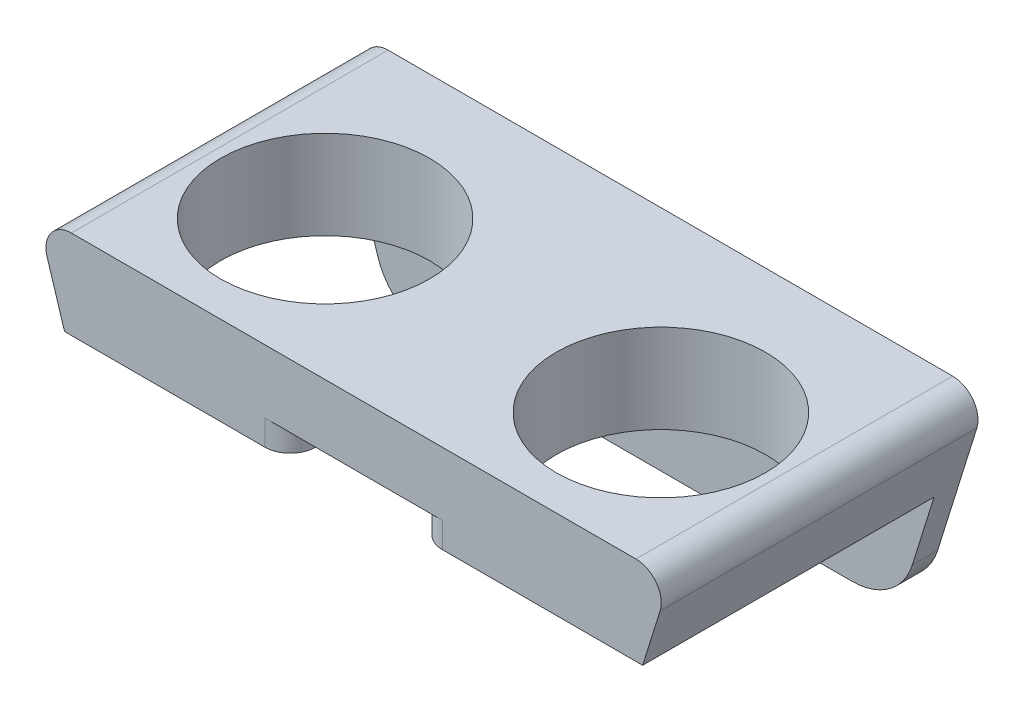
ISO-10303-21;
HEADER;
FILE_DESCRIPTION(('STEP AP214'),'2;1');
FILE_NAME('part.step','',(''),(''),'','','');
FILE_SCHEMA(('AUTOMOTIVE_DESIGN { 1 0 10303 214 1 1 1 1 }'));
ENDSEC;
DATA;
#1=APPLICATION_CONTEXT('core data for automotive mechanical design processes');
#2=APPLICATION_PROTOCOL_DEFINITION('international standard','automotive_design',2000,#1);
#3=PRODUCT_CONTEXT('',#1,'mechanical');
#4=PRODUCT('Part','Part','',(#3));
#5=PRODUCT_RELATED_PRODUCT_CATEGORY('part','',(#4));
#6=PRODUCT_DEFINITION_FORMATION('','',#4);
#7=PRODUCT_DEFINITION_CONTEXT('part definition',#1,'design');
#8=PRODUCT_DEFINITION('design','',#6,#7);
#9=PRODUCT_DEFINITION_SHAPE('','',#8);
#10=(LENGTH_UNIT() NAMED_UNIT(*) SI_UNIT(.MILLI.,.METRE.));
#11=(NAMED_UNIT(*) PLANE_ANGLE_UNIT() SI_UNIT($,.RADIAN.));
#12=(NAMED_UNIT(*) SI_UNIT($,.STERADIAN.) SOLID_ANGLE_UNIT());
#13=UNCERTAINTY_MEASURE_WITH_UNIT(LENGTH_MEASURE(1.E-05),#10,'distance_accuracy_value','');
#14=(GEOMETRIC_REPRESENTATION_CONTEXT(3) GLOBAL_UNCERTAINTY_ASSIGNED_CONTEXT((#13)) GLOBAL_UNIT_ASSIGNED_CONTEXT((#10,
#11,#12)) REPRESENTATION_CONTEXT('',''));
#15=CARTESIAN_POINT('',(0.,0.,0.));
#16=DIRECTION('',(0.,0.,1.));
#17=DIRECTION('',(1.,0.,0.));
#18=AXIS2_PLACEMENT_3D('',#15,#16,#17);
#19=CARTESIAN_POINT('',(0.,7.,0.));
#20=DIRECTION('',(0.,1.,0.));
#21=DIRECTION('',(0.,0.,1.));
#22=AXIS2_PLACEMENT_3D('',#19,#20,#21);
#23=PLANE('',#22);
#24=CARTESIAN_POINT('',(-11.75,7.,-12.));
#25=DIRECTION('',(0.,1.,0.));
#26=DIRECTION('',(0.,0.,1.));
#27=AXIS2_PLACEMENT_3D('',#24,#25,#26);
#28=CIRCLE('',#27,8.25);
#29=CARTESIAN_POINT('',(-11.75,7.,-3.75));
#30=VERTEX_POINT('',#29);
#31=EDGE_CURVE('E415',#30,#30,#28,.T.);
#32=ORIENTED_EDGE('',*,*,#31,.F.);
#33=EDGE_LOOP('',(#32));
#34=FACE_BOUND('',#33,.T.);
#35=CARTESIAN_POINT('',(-38.25,7.,-12.));
#36=DIRECTION('',(0.,1.,0.));
#37=DIRECTION('',(0.,0.,1.));
#38=AXIS2_PLACEMENT_3D('',#35,#36,#37);
#39=CIRCLE('',#38,8.25);
#40=CARTESIAN_POINT('',(-38.25,7.,-3.75));
#41=VERTEX_POINT('',#40);
#42=EDGE_CURVE('E407',#41,#41,#39,.T.);
#43=ORIENTED_EDGE('',*,*,#42,.F.);
#44=EDGE_LOOP('',(#43));
#45=FACE_BOUND('',#44,.T.);
#46=DIRECTION('',(0.,0.,1.));
#47=VECTOR('',#46,1.);
#48=CARTESIAN_POINT('',(-47.27961817322,7.,0.));
#49=LINE('',#48,#47);
#50=CARTESIAN_POINT('',(-47.27961817322,7.,-26.));
#51=VERTEX_POINT('',#50);
#52=CARTESIAN_POINT('',(-47.27961817322,7.,-1.));
#53=VERTEX_POINT('',#52);
#54=EDGE_CURVE('E209',#51,#53,#49,.T.);
#55=ORIENTED_EDGE('',*,*,#54,.T.);
#56=DIRECTION('',(1.,0.,0.));
#57=VECTOR('',#56,1.);
#58=CARTESIAN_POINT('',(0.,7.,-1.));
#59=LINE('',#58,#57);
#60=CARTESIAN_POINT('',(-2.72038182678003,7.,-1.));
#61=VERTEX_POINT('',#60);
#62=EDGE_CURVE('E191',#53,#61,#59,.T.);
#63=ORIENTED_EDGE('',*,*,#62,.T.);
#64=DIRECTION('',(0.,0.,-1.));
#65=VECTOR('',#64,1.);
#66=CARTESIAN_POINT('',(-2.72038182678003,7.,-26.));
#67=LINE('',#66,#65);
#68=CARTESIAN_POINT('',(-2.72038182678003,7.,-26.));
#69=VERTEX_POINT('',#68);
#70=EDGE_CURVE('E206',#61,#69,#67,.T.);
#71=ORIENTED_EDGE('',*,*,#70,.T.);
#72=DIRECTION('',(1.,0.,0.));
#73=VECTOR('',#72,1.);
#74=CARTESIAN_POINT('',(0.,7.,-26.));
#75=LINE('',#74,#73);
#76=EDGE_CURVE('E356',#51,#69,#75,.T.);
#77=ORIENTED_EDGE('',*,*,#76,.F.);
#78=EDGE_LOOP('',(#55,#63,#71,#77));
#79=FACE_BOUND('',#78,.T.);
#80=ADVANCED_FACE('F39',(#34,#45,#79),#23,.T.);
#81=CARTESIAN_POINT('',(0.,0.,0.));
#82=DIRECTION('',(0.,1.,0.));
#83=DIRECTION('',(0.,0.,1.));
#84=AXIS2_PLACEMENT_3D('',#81,#82,#83);
#85=PLANE('',#84);
#86=CARTESIAN_POINT('',(-38.25,0.,-12.));
#87=DIRECTION('',(0.,1.,0.));
#88=DIRECTION('',(0.,0.,1.));
#89=AXIS2_PLACEMENT_3D('',#86,#87,#88);
#90=CIRCLE('',#89,8.25);
#91=CARTESIAN_POINT('',(-38.25,0.,-3.75));
#92=VERTEX_POINT('',#91);
#93=EDGE_CURVE('E397',#92,#92,#90,.T.);
#94=ORIENTED_EDGE('',*,*,#93,.T.);
#95=EDGE_LOOP('',(#94));
#96=FACE_BOUND('',#95,.T.);
#97=CARTESIAN_POINT('',(-11.75,0.,-12.));
#98=DIRECTION('',(0.,1.,0.));
#99=DIRECTION('',(0.,0.,1.));
#100=AXIS2_PLACEMENT_3D('',#97,#98,#99);
#101=CIRCLE('',#100,8.25);
#102=CARTESIAN_POINT('',(-11.75,0.,-3.75));
#103=VERTEX_POINT('',#102);
#104=EDGE_CURVE('E411',#103,#103,#101,.T.);
#105=ORIENTED_EDGE('',*,*,#104,.T.);
#106=EDGE_LOOP('',(#105));
#107=FACE_BOUND('',#106,.T.);
#108=DIRECTION('',(1.,0.,0.));
#109=VECTOR('',#108,1.);
#110=CARTESIAN_POINT('',(-31.25,0.,-22.));
#111=LINE('',#110,#109);
#112=CARTESIAN_POINT('',(-31.25,0.,-22.));
#113=VERTEX_POINT('',#112);
#114=CARTESIAN_POINT('',(-18.75,0.,-22.));
#115=VERTEX_POINT('',#114);
#116=EDGE_CURVE('E383',#113,#115,#111,.T.);
#117=ORIENTED_EDGE('',*,*,#116,.F.);
#118=DIRECTION('',(0.,0.,-1.));
#119=VECTOR('',#118,1.);
#120=CARTESIAN_POINT('',(-31.25,0.,-22.));
#121=LINE('',#120,#119);
#122=CARTESIAN_POINT('',(-31.25,0.,-17.5));
#123=VERTEX_POINT('',#122);
#124=EDGE_CURVE('E359',#123,#113,#121,.T.);
#125=ORIENTED_EDGE('',*,*,#124,.F.);
#126=DIRECTION('',(-1.,0.,0.));
#127=VECTOR('',#126,1.);
#128=CARTESIAN_POINT('',(-31.25,0.,-17.5));
#129=LINE('',#128,#127);
#130=CARTESIAN_POINT('',(-18.75,0.,-17.5));
#131=VERTEX_POINT('',#130);
#132=EDGE_CURVE('E368',#131,#123,#129,.T.);
#133=ORIENTED_EDGE('',*,*,#132,.F.);
#134=DIRECTION('',(0.,0.,1.));
#135=VECTOR('',#134,1.);
#136=CARTESIAN_POINT('',(-18.75,0.,-22.));
#137=LINE('',#136,#135);
#138=EDGE_CURVE('E387',#115,#131,#137,.T.);
#139=ORIENTED_EDGE('',*,*,#138,.F.);
#140=EDGE_LOOP('',(#117,#125,#133,#139));
#141=FACE_BOUND('',#140,.T.);
#142=DIRECTION('',(1.,0.,0.));
#143=VECTOR('',#142,1.);
#144=CARTESIAN_POINT('',(0.,0.,-1.));
#145=LINE('',#144,#143);
#146=CARTESIAN_POINT('',(-18.,0.,-1.));
#147=VERTEX_POINT('',#146);
#148=CARTESIAN_POINT('',(-2.1875,0.,-1.));
#149=VERTEX_POINT('',#148);
#150=EDGE_CURVE('E295',#147,#149,#145,.T.);
#151=ORIENTED_EDGE('',*,*,#150,.F.);
#152=CARTESIAN_POINT('',(-18.,0.,-3.));
#153=DIRECTION('',(0.,1.,0.));
#154=DIRECTION('',(0.,0.,1.));
#155=AXIS2_PLACEMENT_3D('',#152,#153,#154);
#156=CIRCLE('',#155,2.);
#157=CARTESIAN_POINT('',(-20.,0.,-3.));
#158=VERTEX_POINT('',#157);
#159=EDGE_CURVE('E276',#147,#158,#156,.F.);
#160=ORIENTED_EDGE('',*,*,#159,.T.);
#161=DIRECTION('',(0.,0.,1.));
#162=VECTOR('',#161,1.);
#163=CARTESIAN_POINT('',(-20.,0.,-1.));
#164=LINE('',#163,#162);
#165=CARTESIAN_POINT('',(-20.,0.,-4.));
#166=VERTEX_POINT('',#165);
#167=EDGE_CURVE('E492',#166,#158,#164,.T.);
#168=ORIENTED_EDGE('',*,*,#167,.F.);
#169=CARTESIAN_POINT('',(-21.,0.,-4.));
#170=DIRECTION('',(0.,1.,0.));
#171=DIRECTION('',(0.,0.,1.));
#172=AXIS2_PLACEMENT_3D('',#169,#170,#171);
#173=CIRCLE('',#172,1.);
#174=CARTESIAN_POINT('',(-21.,0.,-5.));
#175=VERTEX_POINT('',#174);
#176=EDGE_CURVE('E258',#166,#175,#173,.T.);
#177=ORIENTED_EDGE('',*,*,#176,.T.);
#178=DIRECTION('',(1.,0.,0.));
#179=VECTOR('',#178,1.);
#180=CARTESIAN_POINT('',(-30.,0.,-5.));
#181=LINE('',#180,#179);
#182=CARTESIAN_POINT('',(-29.,0.,-5.));
#183=VERTEX_POINT('',#182);
#184=EDGE_CURVE('E497',#183,#175,#181,.T.);
#185=ORIENTED_EDGE('',*,*,#184,.F.);
#186=CARTESIAN_POINT('',(-29.,0.,-4.));
#187=DIRECTION('',(0.,1.,0.));
#188=DIRECTION('',(0.,0.,1.));
#189=AXIS2_PLACEMENT_3D('',#186,#187,#188);
#190=CIRCLE('',#189,1.);
#191=CARTESIAN_POINT('',(-30.,0.,-4.));
#192=VERTEX_POINT('',#191);
#193=EDGE_CURVE('E261',#183,#192,#190,.T.);
#194=ORIENTED_EDGE('',*,*,#193,.T.);
#195=DIRECTION('',(0.,0.,-1.));
#196=VECTOR('',#195,1.);
#197=CARTESIAN_POINT('',(-30.,0.,-1.));
#198=LINE('',#197,#196);
#199=CARTESIAN_POINT('',(-30.,0.,-3.));
#200=VERTEX_POINT('',#199);
#201=EDGE_CURVE('E482',#200,#192,#198,.T.);
#202=ORIENTED_EDGE('',*,*,#201,.F.);
#203=CARTESIAN_POINT('',(-32.,0.,-3.));
#204=DIRECTION('',(0.,1.,0.));
#205=DIRECTION('',(0.,0.,1.));
#206=AXIS2_PLACEMENT_3D('',#203,#204,#205);
#207=CIRCLE('',#206,2.);
#208=CARTESIAN_POINT('',(-32.,0.,-1.));
#209=VERTEX_POINT('',#208);
#210=EDGE_CURVE('E273',#200,#209,#207,.F.);
#211=ORIENTED_EDGE('',*,*,#210,.T.);
#212=CARTESIAN_POINT('',(-47.8125,0.,-1.));
#213=VERTEX_POINT('',#212);
#214=EDGE_CURVE('E212',#213,#209,#145,.T.);
#215=ORIENTED_EDGE('',*,*,#214,.F.);
#216=DIRECTION('',(0.,0.,-1.));
#217=VECTOR('',#216,1.);
#218=CARTESIAN_POINT('',(-47.8125,0.,0.));
#219=LINE('',#218,#217);
#220=CARTESIAN_POINT('',(-47.8125,0.,-24.));
#221=VERTEX_POINT('',#220);
#222=EDGE_CURVE('E332',#213,#221,#219,.T.);
#223=ORIENTED_EDGE('',*,*,#222,.T.);
#224=DIRECTION('',(-1.,0.,0.));
#225=VECTOR('',#224,1.);
#226=CARTESIAN_POINT('',(-50.,0.,-24.));
#227=LINE('',#226,#225);
#228=CARTESIAN_POINT('',(-2.1875,0.,-24.));
#229=VERTEX_POINT('',#228);
#230=EDGE_CURVE('E419',#229,#221,#227,.T.);
#231=ORIENTED_EDGE('',*,*,#230,.F.);
#232=DIRECTION('',(0.,0.,1.));
#233=VECTOR('',#232,1.);
#234=CARTESIAN_POINT('',(-2.1875,0.,0.));
#235=LINE('',#234,#233);
#236=EDGE_CURVE('E302',#229,#149,#235,.T.);
#237=ORIENTED_EDGE('',*,*,#236,.T.);
#238=EDGE_LOOP('',(#151,#160,#168,#177,#185,#194,#202,#211,#215,#223,#231,#237));
#239=FACE_BOUND('',#238,.T.);
#240=ADVANCED_FACE('F298',(#96,#107,#141,#239),#85,.F.);
#241=CARTESIAN_POINT('',(-5.00000000000001,-9.,-26.));
#242=DIRECTION('',(-0.95447997803503,0.298274993135947,0.));
#243=DIRECTION('',(-0.298274993135947,-0.95447997803503,0.));
#244=AXIS2_PLACEMENT_3D('',#241,#242,#243);
#245=PLANE('',#244);
#246=DIRECTION('',(0.298274993135947,0.95447997803503,0.));
#247=VECTOR('',#246,1.);
#248=CARTESIAN_POINT('',(-5.00000000000001,-9.,-1.));
#249=LINE('',#248,#247);
#250=CARTESIAN_POINT('',(-0.811421870709967,4.40345001372811,-1.));
#251=VERTEX_POINT('',#250);
#252=EDGE_CURVE('E194',#149,#251,#249,.T.);
#253=ORIENTED_EDGE('',*,*,#252,.F.);
#254=ORIENTED_EDGE('',*,*,#236,.F.);
#255=DIRECTION('',(0.298274993135947,0.95447997803503,0.));
#256=VECTOR('',#255,1.);
#257=CARTESIAN_POINT('',(-1.99288256227758,0.622775800711744,-24.));
#258=LINE('',#257,#256);
#259=CARTESIAN_POINT('',(-3.90355467677492,-5.49137496567974,-24.));
#260=VERTEX_POINT('',#259);
#261=EDGE_CURVE('E321',#260,#229,#258,.T.);
#262=ORIENTED_EDGE('',*,*,#261,.F.);
#263=DIRECTION('',(0.,0.,1.));
#264=VECTOR('',#263,1.);
#265=CARTESIAN_POINT('',(-3.90355467677492,-5.49137496567974,-26.));
#266=LINE('',#265,#264);
#267=CARTESIAN_POINT('',(-3.90355467677492,-5.49137496567974,-26.));
#268=VERTEX_POINT('',#267);
#269=EDGE_CURVE('E439',#260,#268,#266,.F.);
#270=ORIENTED_EDGE('',*,*,#269,.T.);
#271=DIRECTION('',(-0.298274993135947,-0.95447997803503,0.));
#272=VECTOR('',#271,1.);
#273=CARTESIAN_POINT('',(-5.00000000000001,-9.,-26.));
#274=LINE('',#273,#272);
#275=CARTESIAN_POINT('',(-0.811421870709967,4.40345001372811,-26.));
#276=VERTEX_POINT('',#275);
#277=EDGE_CURVE('E316',#276,#268,#274,.T.);
#278=ORIENTED_EDGE('',*,*,#277,.F.);
#279=DIRECTION('',(0.,0.,-1.));
#280=VECTOR('',#279,1.);
#281=CARTESIAN_POINT('',(-0.811421870709967,4.40345001372811,0.));
#282=LINE('',#281,#280);
#283=EDGE_CURVE('E201',#276,#251,#282,.F.);
#284=ORIENTED_EDGE('',*,*,#283,.T.);
#285=EDGE_LOOP('',(#253,#254,#262,#270,#278,#284));
#286=FACE_BOUND('',#285,.T.);
#287=ADVANCED_FACE('F465',(#286),#245,.F.);
#288=CARTESIAN_POINT('',(-50.,7.,-26.));
#289=DIRECTION('',(0.95447997803503,0.298274993135946,0.));
#290=DIRECTION('',(-0.298274993135946,0.95447997803503,0.));
#291=AXIS2_PLACEMENT_3D('',#288,#289,#290);
#292=PLANE('',#291);
#293=DIRECTION('',(0.298274993135946,-0.95447997803503,0.));
#294=VECTOR('',#293,1.);
#295=CARTESIAN_POINT('',(-50.,7.,-1.));
#296=LINE('',#295,#294);
#297=CARTESIAN_POINT('',(-49.18857812929,4.40345001372811,-1.));
#298=VERTEX_POINT('',#297);
#299=EDGE_CURVE('E313',#298,#213,#296,.T.);
#300=ORIENTED_EDGE('',*,*,#299,.F.);
#301=DIRECTION('',(0.,0.,1.));
#302=VECTOR('',#301,1.);
#303=CARTESIAN_POINT('',(-49.18857812929,4.40345001372811,-26.));
#304=LINE('',#303,#302);
#305=CARTESIAN_POINT('',(-49.18857812929,4.40345001372811,-26.));
#306=VERTEX_POINT('',#305);
#307=EDGE_CURVE('E222',#298,#306,#304,.F.);
#308=ORIENTED_EDGE('',*,*,#307,.T.);
#309=DIRECTION('',(-0.298274993135946,0.95447997803503,0.));
#310=VECTOR('',#309,1.);
#311=CARTESIAN_POINT('',(-50.,7.,-26.));
#312=LINE('',#311,#310);
#313=CARTESIAN_POINT('',(-46.0964453232251,-5.49137496567973,-26.));
#314=VERTEX_POINT('',#313);
#315=EDGE_CURVE('E317',#314,#306,#312,.T.);
#316=ORIENTED_EDGE('',*,*,#315,.F.);
#317=DIRECTION('',(0.,0.,1.));
#318=VECTOR('',#317,1.);
#319=CARTESIAN_POINT('',(-46.0964453232251,-5.49137496567973,-26.));
#320=LINE('',#319,#318);
#321=CARTESIAN_POINT('',(-46.0964453232251,-5.49137496567973,-24.));
#322=VERTEX_POINT('',#321);
#323=EDGE_CURVE('E218',#314,#322,#320,.T.);
#324=ORIENTED_EDGE('',*,*,#323,.T.);
#325=DIRECTION('',(0.298274993135946,-0.95447997803503,0.));
#326=VECTOR('',#325,1.);
#327=CARTESIAN_POINT('',(-43.55871886121,-13.6120996441281,-24.));
#328=LINE('',#327,#326);
#329=EDGE_CURVE('E328',#221,#322,#328,.T.);
#330=ORIENTED_EDGE('',*,*,#329,.F.);
#331=ORIENTED_EDGE('',*,*,#222,.F.);
#332=EDGE_LOOP('',(#300,#308,#316,#324,#330,#331));
#333=FACE_BOUND('',#332,.T.);
#334=ADVANCED_FACE('F471',(#333),#292,.F.);
#335=CARTESIAN_POINT('',(-47.27961817322,5.,0.));
#336=DIRECTION('',(0.,0.,-1.));
#337=DIRECTION('',(-1.,0.,0.));
#338=AXIS2_PLACEMENT_3D('',#335,#336,#337);
#339=CYLINDRICAL_SURFACE('',#338,2.);
#340=ORIENTED_EDGE('',*,*,#307,.F.);
#341=CARTESIAN_POINT('',(-47.27961817322,5.,-1.));
#342=DIRECTION('',(0.,0.,1.));
#343=DIRECTION('',(1.,0.,0.));
#344=AXIS2_PLACEMENT_3D('',#341,#342,#343);
#345=CIRCLE('',#344,2.);
#346=EDGE_CURVE('E211',#298,#53,#345,.F.);
#347=ORIENTED_EDGE('',*,*,#346,.T.);
#348=ORIENTED_EDGE('',*,*,#54,.F.);
#349=CARTESIAN_POINT('',(-47.27961817322,5.,-26.));
#350=DIRECTION('',(0.,0.,-1.));
#351=DIRECTION('',(-1.,0.,0.));
#352=AXIS2_PLACEMENT_3D('',#349,#350,#351);
#353=CIRCLE('',#352,2.);
#354=EDGE_CURVE('E233',#306,#51,#353,.T.);
#355=ORIENTED_EDGE('',*,*,#354,.F.);
#356=EDGE_LOOP('',(#340,#347,#348,#355));
#357=FACE_BOUND('',#356,.T.);
#358=ADVANCED_FACE('F479',(#357),#339,.T.);
#359=CARTESIAN_POINT('',(-2.72038182678003,5.,0.));
#360=DIRECTION('',(0.,0.,1.));
#361=DIRECTION('',(1.,0.,0.));
#362=AXIS2_PLACEMENT_3D('',#359,#360,#361);
#363=CYLINDRICAL_SURFACE('',#362,2.);
#364=ORIENTED_EDGE('',*,*,#70,.F.);
#365=CARTESIAN_POINT('',(-2.72038182678003,5.,-1.));
#366=DIRECTION('',(0.,0.,1.));
#367=DIRECTION('',(1.,0.,0.));
#368=AXIS2_PLACEMENT_3D('',#365,#366,#367);
#369=CIRCLE('',#368,2.);
#370=EDGE_CURVE('E188',#61,#251,#369,.F.);
#371=ORIENTED_EDGE('',*,*,#370,.T.);
#372=ORIENTED_EDGE('',*,*,#283,.F.);
#373=CARTESIAN_POINT('',(-2.72038182678003,5.,-26.));
#374=DIRECTION('',(0.,0.,-1.));
#375=DIRECTION('',(-1.,0.,0.));
#376=AXIS2_PLACEMENT_3D('',#373,#374,#375);
#377=CIRCLE('',#376,2.);
#378=EDGE_CURVE('E215',#69,#276,#377,.T.);
#379=ORIENTED_EDGE('',*,*,#378,.F.);
#380=EDGE_LOOP('',(#364,#371,#372,#379));
#381=FACE_BOUND('',#380,.T.);
#382=ADVANCED_FACE('F214',(#381),#363,.T.);
#383=CARTESIAN_POINT('',(-11.75,7.,-12.));
#384=DIRECTION('',(0.,-1.,0.));
#385=DIRECTION('',(0.,0.,-1.));
#386=AXIS2_PLACEMENT_3D('',#383,#384,#385);
#387=CYLINDRICAL_SURFACE('',#386,8.25);
#388=ORIENTED_EDGE('',*,*,#31,.T.);
#389=EDGE_LOOP('',(#388));
#390=FACE_BOUND('',#389,.T.);
#391=ORIENTED_EDGE('',*,*,#104,.F.);
#392=EDGE_LOOP('',(#391));
#393=FACE_BOUND('',#392,.T.);
#394=ADVANCED_FACE('F538',(#390,#393),#387,.F.);
#395=CARTESIAN_POINT('',(-38.25,7.,-12.));
#396=DIRECTION('',(0.,-1.,0.));
#397=DIRECTION('',(0.,0.,-1.));
#398=AXIS2_PLACEMENT_3D('',#395,#396,#397);
#399=CYLINDRICAL_SURFACE('',#398,8.25);
#400=ORIENTED_EDGE('',*,*,#42,.T.);
#401=EDGE_LOOP('',(#400));
#402=FACE_BOUND('',#401,.T.);
#403=ORIENTED_EDGE('',*,*,#93,.F.);
#404=EDGE_LOOP('',(#403));
#405=FACE_BOUND('',#404,.T.);
#406=ADVANCED_FACE('F754',(#402,#405),#399,.F.);
#407=CARTESIAN_POINT('',(-31.25,4.02250410638095,-22.));
#408=DIRECTION('',(-1.,0.,0.));
#409=DIRECTION('',(0.,0.,1.));
#410=AXIS2_PLACEMENT_3D('',#407,#408,#409);
#411=PLANE('',#410);
#412=ORIENTED_EDGE('',*,*,#124,.T.);
#413=DIRECTION('',(0.,-1.,0.));
#414=VECTOR('',#413,1.);
#415=CARTESIAN_POINT('',(-31.25,4.02250410638095,-22.));
#416=LINE('',#415,#414);
#417=CARTESIAN_POINT('',(-31.25,4.02250410638095,-22.));
#418=VERTEX_POINT('',#417);
#419=EDGE_CURVE('E380',#418,#113,#416,.T.);
#420=ORIENTED_EDGE('',*,*,#419,.F.);
#421=DIRECTION('',(0.,0.,-1.));
#422=VECTOR('',#421,1.);
#423=CARTESIAN_POINT('',(-31.25,4.02250410638095,-22.));
#424=LINE('',#423,#422);
#425=CARTESIAN_POINT('',(-31.25,4.02250410638095,-17.5));
#426=VERTEX_POINT('',#425);
#427=EDGE_CURVE('E363',#426,#418,#424,.T.);
#428=ORIENTED_EDGE('',*,*,#427,.F.);
#429=DIRECTION('',(0.,-1.,0.));
#430=VECTOR('',#429,1.);
#431=CARTESIAN_POINT('',(-31.25,4.02250410638095,-17.5));
#432=LINE('',#431,#430);
#433=EDGE_CURVE('E394',#426,#123,#432,.T.);
#434=ORIENTED_EDGE('',*,*,#433,.T.);
#435=EDGE_LOOP('',(#412,#420,#428,#434));
#436=FACE_BOUND('',#435,.T.);
#437=ADVANCED_FACE('F744',(#436),#411,.F.);
#438=CARTESIAN_POINT('',(-31.25,4.02250410638095,-17.5));
#439=DIRECTION('',(0.,0.,1.));
#440=DIRECTION('',(1.,0.,0.));
#441=AXIS2_PLACEMENT_3D('',#438,#439,#440);
#442=PLANE('',#441);
#443=ORIENTED_EDGE('',*,*,#132,.T.);
#444=ORIENTED_EDGE('',*,*,#433,.F.);
#445=DIRECTION('',(-1.,0.,0.));
#446=VECTOR('',#445,1.);
#447=CARTESIAN_POINT('',(-31.25,4.02250410638095,-17.5));
#448=LINE('',#447,#446);
#449=CARTESIAN_POINT('',(-18.75,4.02250410638095,-17.5));
#450=VERTEX_POINT('',#449);
#451=EDGE_CURVE('E376',#450,#426,#448,.T.);
#452=ORIENTED_EDGE('',*,*,#451,.F.);
#453=DIRECTION('',(0.,-1.,0.));
#454=VECTOR('',#453,1.);
#455=CARTESIAN_POINT('',(-18.75,4.02250410638095,-17.5));
#456=LINE('',#455,#454);
#457=EDGE_CURVE('E398',#450,#131,#456,.T.);
#458=ORIENTED_EDGE('',*,*,#457,.T.);
#459=EDGE_LOOP('',(#443,#444,#452,#458));
#460=FACE_BOUND('',#459,.T.);
#461=ADVANCED_FACE('F734',(#460),#442,.F.);
#462=CARTESIAN_POINT('',(-18.75,4.02250410638095,-22.));
#463=DIRECTION('',(1.,0.,0.));
#464=DIRECTION('',(0.,0.,-1.));
#465=AXIS2_PLACEMENT_3D('',#462,#463,#464);
#466=PLANE('',#465);
#467=ORIENTED_EDGE('',*,*,#138,.T.);
#468=ORIENTED_EDGE('',*,*,#457,.F.);
#469=DIRECTION('',(0.,0.,1.));
#470=VECTOR('',#469,1.);
#471=CARTESIAN_POINT('',(-18.75,4.02250410638095,-22.));
#472=LINE('',#471,#470);
#473=CARTESIAN_POINT('',(-18.75,4.02250410638095,-22.));
#474=VERTEX_POINT('',#473);
#475=EDGE_CURVE('E372',#474,#450,#472,.T.);
#476=ORIENTED_EDGE('',*,*,#475,.F.);
#477=DIRECTION('',(0.,-1.,0.));
#478=VECTOR('',#477,1.);
#479=CARTESIAN_POINT('',(-18.75,4.02250410638095,-22.));
#480=LINE('',#479,#478);
#481=EDGE_CURVE('E401',#474,#115,#480,.T.);
#482=ORIENTED_EDGE('',*,*,#481,.T.);
#483=EDGE_LOOP('',(#467,#468,#476,#482));
#484=FACE_BOUND('',#483,.T.);
#485=ADVANCED_FACE('F724',(#484),#466,.F.);
#486=CARTESIAN_POINT('',(-31.25,4.02250410638095,-22.));
#487=DIRECTION('',(0.,0.,-1.));
#488=DIRECTION('',(-1.,0.,0.));
#489=AXIS2_PLACEMENT_3D('',#486,#487,#488);
#490=PLANE('',#489);
#491=ORIENTED_EDGE('',*,*,#116,.T.);
#492=ORIENTED_EDGE('',*,*,#481,.F.);
#493=DIRECTION('',(1.,0.,0.));
#494=VECTOR('',#493,1.);
#495=CARTESIAN_POINT('',(-31.25,4.02250410638095,-22.));
#496=LINE('',#495,#494);
#497=EDGE_CURVE('E367',#418,#474,#496,.T.);
#498=ORIENTED_EDGE('',*,*,#497,.F.);
#499=ORIENTED_EDGE('',*,*,#419,.T.);
#500=EDGE_LOOP('',(#491,#492,#498,#499));
#501=FACE_BOUND('',#500,.T.);
#502=ADVANCED_FACE('F714',(#501),#490,.F.);
#503=CARTESIAN_POINT('',(0.,4.02250410638095,0.));
#504=DIRECTION('',(0.,1.,0.));
#505=DIRECTION('',(0.,0.,1.));
#506=AXIS2_PLACEMENT_3D('',#503,#504,#505);
#507=PLANE('',#506);
#508=ORIENTED_EDGE('',*,*,#427,.T.);
#509=ORIENTED_EDGE('',*,*,#497,.T.);
#510=ORIENTED_EDGE('',*,*,#475,.T.);
#511=ORIENTED_EDGE('',*,*,#451,.T.);
#512=EDGE_LOOP('',(#508,#509,#510,#511));
#513=FACE_BOUND('',#512,.T.);
#514=ADVANCED_FACE('F690',(#513),#507,.F.);
#515=CARTESIAN_POINT('',(0.,0.,-24.));
#516=DIRECTION('',(0.,0.,-1.));
#517=DIRECTION('',(-1.,0.,0.));
#518=AXIS2_PLACEMENT_3D('',#515,#516,#517);
#519=PLANE('',#518);
#520=CARTESIAN_POINT('',(-12.5,-6.,-24.));
#521=DIRECTION('',(0.,0.,-1.));
#522=DIRECTION('',(-1.,0.,0.));
#523=AXIS2_PLACEMENT_3D('',#520,#521,#522);
#524=CIRCLE('',#523,1.55);
#525=CARTESIAN_POINT('',(-14.05,-6.,-24.));
#526=VERTEX_POINT('',#525);
#527=EDGE_CURVE('E340',#526,#526,#524,.T.);
#528=ORIENTED_EDGE('',*,*,#527,.T.);
#529=EDGE_LOOP('',(#528));
#530=FACE_BOUND('',#529,.T.);
#531=CARTESIAN_POINT('',(-37.5,-6.,-24.));
#532=DIRECTION('',(0.,0.,-1.));
#533=DIRECTION('',(-1.,0.,0.));
#534=AXIS2_PLACEMENT_3D('',#531,#532,#533);
#535=CIRCLE('',#534,1.55);
#536=CARTESIAN_POINT('',(-39.05,-6.,-24.));
#537=VERTEX_POINT('',#536);
#538=EDGE_CURVE('E335',#537,#537,#535,.T.);
#539=ORIENTED_EDGE('',*,*,#538,.T.);
#540=EDGE_LOOP('',(#539));
#541=FACE_BOUND('',#540,.T.);
#542=DIRECTION('',(-1.,0.,0.));
#543=VECTOR('',#542,1.);
#544=CARTESIAN_POINT('',(0.,-9.,-24.));
#545=LINE('',#544,#543);
#546=CARTESIAN_POINT('',(-8.67595456695007,-9.,-24.));
#547=VERTEX_POINT('',#546);
#548=CARTESIAN_POINT('',(-41.3240454330499,-9.,-24.));
#549=VERTEX_POINT('',#548);
#550=EDGE_CURVE('E348',#547,#549,#545,.T.);
#551=ORIENTED_EDGE('',*,*,#550,.F.);
#552=CARTESIAN_POINT('',(-8.67595456695007,-4.,-24.));
#553=DIRECTION('',(0.,0.,-1.));
#554=DIRECTION('',(-1.,0.,0.));
#555=AXIS2_PLACEMENT_3D('',#552,#553,#554);
#556=CIRCLE('',#555,5.);
#557=EDGE_CURVE('E436',#547,#260,#556,.F.);
#558=ORIENTED_EDGE('',*,*,#557,.T.);
#559=ORIENTED_EDGE('',*,*,#261,.T.);
#560=ORIENTED_EDGE('',*,*,#230,.T.);
#561=ORIENTED_EDGE('',*,*,#329,.T.);
#562=CARTESIAN_POINT('',(-41.3240454330499,-4.,-24.));
#563=DIRECTION('',(0.,0.,-1.));
#564=DIRECTION('',(-1.,0.,0.));
#565=AXIS2_PLACEMENT_3D('',#562,#563,#564);
#566=CIRCLE('',#565,5.);
#567=EDGE_CURVE('E433',#322,#549,#566,.F.);
#568=ORIENTED_EDGE('',*,*,#567,.T.);
#569=EDGE_LOOP('',(#551,#558,#559,#560,#561,#568));
#570=FACE_BOUND('',#569,.T.);
#571=ADVANCED_FACE('F463',(#530,#541,#570),#519,.F.);
#572=CARTESIAN_POINT('',(0.,0.,-26.));
#573=DIRECTION('',(0.,0.,-1.));
#574=DIRECTION('',(-1.,0.,0.));
#575=AXIS2_PLACEMENT_3D('',#572,#573,#574);
#576=PLANE('',#575);
#577=ORIENTED_EDGE('',*,*,#315,.T.);
#578=ORIENTED_EDGE('',*,*,#354,.T.);
#579=ORIENTED_EDGE('',*,*,#76,.T.);
#580=ORIENTED_EDGE('',*,*,#378,.T.);
#581=ORIENTED_EDGE('',*,*,#277,.T.);
#582=CARTESIAN_POINT('',(-8.67595456695007,-4.,-26.));
#583=DIRECTION('',(0.,0.,-1.));
#584=DIRECTION('',(-1.,0.,0.));
#585=AXIS2_PLACEMENT_3D('',#582,#583,#584);
#586=CIRCLE('',#585,5.);
#587=CARTESIAN_POINT('',(-8.67595456695007,-9.,-26.));
#588=VERTEX_POINT('',#587);
#589=EDGE_CURVE('E225',#268,#588,#586,.T.);
#590=ORIENTED_EDGE('',*,*,#589,.T.);
#591=DIRECTION('',(-1.,0.,0.));
#592=VECTOR('',#591,1.);
#593=CARTESIAN_POINT('',(0.,-9.,-26.));
#594=LINE('',#593,#592);
#595=CARTESIAN_POINT('',(-41.3240454330499,-9.,-26.));
#596=VERTEX_POINT('',#595);
#597=EDGE_CURVE('E352',#588,#596,#594,.T.);
#598=ORIENTED_EDGE('',*,*,#597,.T.);
#599=CARTESIAN_POINT('',(-41.3240454330499,-4.,-26.));
#600=DIRECTION('',(0.,0.,-1.));
#601=DIRECTION('',(-1.,0.,0.));
#602=AXIS2_PLACEMENT_3D('',#599,#600,#601);
#603=CIRCLE('',#602,5.);
#604=EDGE_CURVE('E443',#596,#314,#603,.T.);
#605=ORIENTED_EDGE('',*,*,#604,.T.);
#606=EDGE_LOOP('',(#577,#578,#579,#580,#581,#590,#598,#605));
#607=FACE_BOUND('',#606,.T.);
#608=CARTESIAN_POINT('',(-12.5,-6.,-26.));
#609=DIRECTION('',(0.,0.,-1.));
#610=DIRECTION('',(-1.,0.,0.));
#611=AXIS2_PLACEMENT_3D('',#608,#609,#610);
#612=CIRCLE('',#611,1.55);
#613=CARTESIAN_POINT('',(-14.05,-6.,-26.));
#614=VERTEX_POINT('',#613);
#615=EDGE_CURVE('E344',#614,#614,#612,.T.);
#616=ORIENTED_EDGE('',*,*,#615,.F.);
#617=EDGE_LOOP('',(#616));
#618=FACE_BOUND('',#617,.T.);
#619=CARTESIAN_POINT('',(-37.5,-6.,-26.));
#620=DIRECTION('',(0.,0.,-1.));
#621=DIRECTION('',(-1.,0.,0.));
#622=AXIS2_PLACEMENT_3D('',#619,#620,#621);
#623=CIRCLE('',#622,1.55);
#624=CARTESIAN_POINT('',(-39.05,-6.,-26.));
#625=VERTEX_POINT('',#624);
#626=EDGE_CURVE('E336',#625,#625,#623,.T.);
#627=ORIENTED_EDGE('',*,*,#626,.F.);
#628=EDGE_LOOP('',(#627));
#629=FACE_BOUND('',#628,.T.);
#630=ADVANCED_FACE('F449',(#607,#618,#629),#576,.T.);
#631=CARTESIAN_POINT('',(0.,-9.,-26.));
#632=DIRECTION('',(0.,1.,0.));
#633=DIRECTION('',(0.,0.,1.));
#634=AXIS2_PLACEMENT_3D('',#631,#632,#633);
#635=PLANE('',#634);
#636=ORIENTED_EDGE('',*,*,#597,.F.);
#637=DIRECTION('',(0.,0.,1.));
#638=VECTOR('',#637,1.);
#639=CARTESIAN_POINT('',(-8.67595456695007,-9.,-26.));
#640=LINE('',#639,#638);
#641=EDGE_CURVE('E429',#588,#547,#640,.T.);
#642=ORIENTED_EDGE('',*,*,#641,.T.);
#643=ORIENTED_EDGE('',*,*,#550,.T.);
#644=DIRECTION('',(0.,0.,1.));
#645=VECTOR('',#644,1.);
#646=CARTESIAN_POINT('',(-41.3240454330499,-9.,-26.));
#647=LINE('',#646,#645);
#648=EDGE_CURVE('E426',#549,#596,#647,.F.);
#649=ORIENTED_EDGE('',*,*,#648,.T.);
#650=EDGE_LOOP('',(#636,#642,#643,#649));
#651=FACE_BOUND('',#650,.T.);
#652=ADVANCED_FACE('F457',(#651),#635,.F.);
#653=CARTESIAN_POINT('',(-12.5,-6.,-26.));
#654=DIRECTION('',(0.,0.,1.));
#655=DIRECTION('',(1.,0.,0.));
#656=AXIS2_PLACEMENT_3D('',#653,#654,#655);
#657=CYLINDRICAL_SURFACE('',#656,1.55);
#658=ORIENTED_EDGE('',*,*,#615,.T.);
#659=EDGE_LOOP('',(#658));
#660=FACE_BOUND('',#659,.T.);
#661=ORIENTED_EDGE('',*,*,#527,.F.);
#662=EDGE_LOOP('',(#661));
#663=FACE_BOUND('',#662,.T.);
#664=ADVANCED_FACE('F681',(#660,#663),#657,.F.);
#665=CARTESIAN_POINT('',(-37.5,-6.,-26.));
#666=DIRECTION('',(0.,0.,1.));
#667=DIRECTION('',(1.,0.,0.));
#668=AXIS2_PLACEMENT_3D('',#665,#666,#667);
#669=CYLINDRICAL_SURFACE('',#668,1.55);
#670=ORIENTED_EDGE('',*,*,#626,.T.);
#671=EDGE_LOOP('',(#670));
#672=FACE_BOUND('',#671,.T.);
#673=ORIENTED_EDGE('',*,*,#538,.F.);
#674=EDGE_LOOP('',(#673));
#675=FACE_BOUND('',#674,.T.);
#676=ADVANCED_FACE('F543',(#672,#675),#669,.F.);
#677=CARTESIAN_POINT('',(-8.67595456695007,-4.,-26.));
#678=DIRECTION('',(0.,0.,1.));
#679=DIRECTION('',(1.,0.,0.));
#680=AXIS2_PLACEMENT_3D('',#677,#678,#679);
#681=CYLINDRICAL_SURFACE('',#680,5.);
#682=ORIENTED_EDGE('',*,*,#589,.F.);
#683=ORIENTED_EDGE('',*,*,#269,.F.);
#684=ORIENTED_EDGE('',*,*,#557,.F.);
#685=ORIENTED_EDGE('',*,*,#641,.F.);
#686=EDGE_LOOP('',(#682,#683,#684,#685));
#687=FACE_BOUND('',#686,.T.);
#688=ADVANCED_FACE('F460',(#687),#681,.T.);
#689=CARTESIAN_POINT('',(-41.3240454330499,-4.,-26.));
#690=DIRECTION('',(0.,0.,1.));
#691=DIRECTION('',(1.,0.,0.));
#692=AXIS2_PLACEMENT_3D('',#689,#690,#691);
#693=CYLINDRICAL_SURFACE('',#692,5.);
#694=ORIENTED_EDGE('',*,*,#604,.F.);
#695=ORIENTED_EDGE('',*,*,#648,.F.);
#696=ORIENTED_EDGE('',*,*,#567,.F.);
#697=ORIENTED_EDGE('',*,*,#323,.F.);
#698=EDGE_LOOP('',(#694,#695,#696,#697));
#699=FACE_BOUND('',#698,.T.);
#700=ADVANCED_FACE('F475',(#699),#693,.T.);
#701=CARTESIAN_POINT('',(0.,0.,-1.));
#702=DIRECTION('',(0.,0.,1.));
#703=DIRECTION('',(1.,0.,0.));
#704=AXIS2_PLACEMENT_3D('',#701,#702,#703);
#705=PLANE('',#704);
#706=DIRECTION('',(-1.,0.,0.));
#707=VECTOR('',#706,1.);
#708=CARTESIAN_POINT('',(-30.,2.,-1.));
#709=LINE('',#708,#707);
#710=CARTESIAN_POINT('',(-18.,2.,-1.));
#711=VERTEX_POINT('',#710);
#712=CARTESIAN_POINT('',(-32.,2.,-1.));
#713=VERTEX_POINT('',#712);
#714=EDGE_CURVE('E290',#711,#713,#709,.T.);
#715=ORIENTED_EDGE('',*,*,#714,.F.);
#716=DIRECTION('',(0.,-1.,0.));
#717=VECTOR('',#716,1.);
#718=CARTESIAN_POINT('',(-18.,0.,-1.));
#719=LINE('',#718,#717);
#720=EDGE_CURVE('E269',#711,#147,#719,.T.);
#721=ORIENTED_EDGE('',*,*,#720,.T.);
#722=ORIENTED_EDGE('',*,*,#150,.T.);
#723=ORIENTED_EDGE('',*,*,#252,.T.);
#724=ORIENTED_EDGE('',*,*,#370,.F.);
#725=ORIENTED_EDGE('',*,*,#62,.F.);
#726=ORIENTED_EDGE('',*,*,#346,.F.);
#727=ORIENTED_EDGE('',*,*,#299,.T.);
#728=ORIENTED_EDGE('',*,*,#214,.T.);
#729=DIRECTION('',(0.,-1.,0.));
#730=VECTOR('',#729,1.);
#731=CARTESIAN_POINT('',(-32.,2.,-1.));
#732=LINE('',#731,#730);
#733=EDGE_CURVE('E265',#209,#713,#732,.F.);
#734=ORIENTED_EDGE('',*,*,#733,.T.);
#735=EDGE_LOOP('',(#715,#721,#722,#723,#724,#725,#726,#727,#728,#734));
#736=FACE_BOUND('',#735,.T.);
#737=ADVANCED_FACE('F190',(#736),#705,.T.);
#738=CARTESIAN_POINT('',(-30.,2.,-1.));
#739=DIRECTION('',(-1.,0.,0.));
#740=DIRECTION('',(0.,0.,1.));
#741=AXIS2_PLACEMENT_3D('',#738,#739,#740);
#742=PLANE('',#741);
#743=DIRECTION('',(0.,0.,-1.));
#744=VECTOR('',#743,1.);
#745=CARTESIAN_POINT('',(-30.,2.,-1.));
#746=LINE('',#745,#744);
#747=CARTESIAN_POINT('',(-30.,2.,-3.));
#748=VERTEX_POINT('',#747);
#749=CARTESIAN_POINT('',(-30.,2.,-4.));
#750=VERTEX_POINT('',#749);
#751=EDGE_CURVE('E487',#748,#750,#746,.T.);
#752=ORIENTED_EDGE('',*,*,#751,.F.);
#753=DIRECTION('',(0.,-1.,0.));
#754=VECTOR('',#753,1.);
#755=CARTESIAN_POINT('',(-30.,0.,-3.));
#756=LINE('',#755,#754);
#757=EDGE_CURVE('E281',#748,#200,#756,.T.);
#758=ORIENTED_EDGE('',*,*,#757,.T.);
#759=ORIENTED_EDGE('',*,*,#201,.T.);
#760=DIRECTION('',(0.,-1.,0.));
#761=VECTOR('',#760,1.);
#762=CARTESIAN_POINT('',(-30.,2.,-4.));
#763=LINE('',#762,#761);
#764=EDGE_CURVE('E254',#192,#750,#763,.F.);
#765=ORIENTED_EDGE('',*,*,#764,.T.);
#766=EDGE_LOOP('',(#752,#758,#759,#765));
#767=FACE_BOUND('',#766,.T.);
#768=ADVANCED_FACE('F486',(#767),#742,.F.);
#769=CARTESIAN_POINT('',(-20.,2.,-1.));
#770=DIRECTION('',(1.,0.,0.));
#771=DIRECTION('',(0.,0.,-1.));
#772=AXIS2_PLACEMENT_3D('',#769,#770,#771);
#773=PLANE('',#772);
#774=ORIENTED_EDGE('',*,*,#167,.T.);
#775=DIRECTION('',(0.,-1.,0.));
#776=VECTOR('',#775,1.);
#777=CARTESIAN_POINT('',(-20.,2.,-3.));
#778=LINE('',#777,#776);
#779=CARTESIAN_POINT('',(-20.,2.,-3.));
#780=VERTEX_POINT('',#779);
#781=EDGE_CURVE('E61',#158,#780,#778,.F.);
#782=ORIENTED_EDGE('',*,*,#781,.T.);
#783=DIRECTION('',(0.,0.,1.));
#784=VECTOR('',#783,1.);
#785=CARTESIAN_POINT('',(-20.,2.,-1.));
#786=LINE('',#785,#784);
#787=CARTESIAN_POINT('',(-20.,2.,-4.));
#788=VERTEX_POINT('',#787);
#789=EDGE_CURVE('E291',#788,#780,#786,.T.);
#790=ORIENTED_EDGE('',*,*,#789,.F.);
#791=DIRECTION('',(0.,-1.,0.));
#792=VECTOR('',#791,1.);
#793=CARTESIAN_POINT('',(-20.,0.,-4.));
#794=LINE('',#793,#792);
#795=EDGE_CURVE('E200',#788,#166,#794,.T.);
#796=ORIENTED_EDGE('',*,*,#795,.T.);
#797=EDGE_LOOP('',(#774,#782,#790,#796));
#798=FACE_BOUND('',#797,.T.);
#799=ADVANCED_FACE('F517',(#798),#773,.F.);
#800=CARTESIAN_POINT('',(-30.,2.,-5.));
#801=DIRECTION('',(0.,0.,-1.));
#802=DIRECTION('',(-1.,0.,0.));
#803=AXIS2_PLACEMENT_3D('',#800,#801,#802);
#804=PLANE('',#803);
#805=ORIENTED_EDGE('',*,*,#184,.T.);
#806=DIRECTION('',(0.,-1.,0.));
#807=VECTOR('',#806,1.);
#808=CARTESIAN_POINT('',(-21.,2.,-5.));
#809=LINE('',#808,#807);
#810=CARTESIAN_POINT('',(-21.,2.,-5.));
#811=VERTEX_POINT('',#810);
#812=EDGE_CURVE('E245',#175,#811,#809,.F.);
#813=ORIENTED_EDGE('',*,*,#812,.T.);
#814=DIRECTION('',(1.,0.,0.));
#815=VECTOR('',#814,1.);
#816=CARTESIAN_POINT('',(-30.,2.,-5.));
#817=LINE('',#816,#815);
#818=CARTESIAN_POINT('',(-29.,2.,-5.));
#819=VERTEX_POINT('',#818);
#820=EDGE_CURVE('E491',#819,#811,#817,.T.);
#821=ORIENTED_EDGE('',*,*,#820,.F.);
#822=DIRECTION('',(0.,-1.,0.));
#823=VECTOR('',#822,1.);
#824=CARTESIAN_POINT('',(-29.,0.,-5.));
#825=LINE('',#824,#823);
#826=EDGE_CURVE('E241',#819,#183,#825,.T.);
#827=ORIENTED_EDGE('',*,*,#826,.T.);
#828=EDGE_LOOP('',(#805,#813,#821,#827));
#829=FACE_BOUND('',#828,.T.);
#830=ADVANCED_FACE('F510',(#829),#804,.F.);
#831=CARTESIAN_POINT('',(0.,2.,0.));
#832=DIRECTION('',(0.,-1.,0.));
#833=DIRECTION('',(0.,0.,-1.));
#834=AXIS2_PLACEMENT_3D('',#831,#832,#833);
#835=PLANE('',#834);
#836=ORIENTED_EDGE('',*,*,#820,.T.);
#837=CARTESIAN_POINT('',(-21.,2.,-4.));
#838=DIRECTION('',(0.,-1.,0.));
#839=DIRECTION('',(0.,0.,-1.));
#840=AXIS2_PLACEMENT_3D('',#837,#838,#839);
#841=CIRCLE('',#840,1.);
#842=EDGE_CURVE('E251',#811,#788,#841,.T.);
#843=ORIENTED_EDGE('',*,*,#842,.T.);
#844=ORIENTED_EDGE('',*,*,#789,.T.);
#845=CARTESIAN_POINT('',(-18.,2.,-3.));
#846=DIRECTION('',(0.,-1.,0.));
#847=DIRECTION('',(0.,0.,-1.));
#848=AXIS2_PLACEMENT_3D('',#845,#846,#847);
#849=CIRCLE('',#848,2.);
#850=EDGE_CURVE('E48',#780,#711,#849,.F.);
#851=ORIENTED_EDGE('',*,*,#850,.T.);
#852=ORIENTED_EDGE('',*,*,#714,.T.);
#853=CARTESIAN_POINT('',(-32.,2.,-3.));
#854=DIRECTION('',(0.,-1.,0.));
#855=DIRECTION('',(0.,0.,-1.));
#856=AXIS2_PLACEMENT_3D('',#853,#854,#855);
#857=CIRCLE('',#856,2.);
#858=EDGE_CURVE('E11',#713,#748,#857,.F.);
#859=ORIENTED_EDGE('',*,*,#858,.T.);
#860=ORIENTED_EDGE('',*,*,#751,.T.);
#861=CARTESIAN_POINT('',(-29.,2.,-4.));
#862=DIRECTION('',(0.,-1.,0.));
#863=DIRECTION('',(0.,0.,-1.));
#864=AXIS2_PLACEMENT_3D('',#861,#862,#863);
#865=CIRCLE('',#864,1.);
#866=EDGE_CURVE('E248',#750,#819,#865,.T.);
#867=ORIENTED_EDGE('',*,*,#866,.T.);
#868=EDGE_LOOP('',(#836,#843,#844,#851,#852,#859,#860,#867));
#869=FACE_BOUND('',#868,.T.);
#870=ADVANCED_FACE('F289',(#869),#835,.T.);
#871=CARTESIAN_POINT('',(-21.,2.,-4.));
#872=DIRECTION('',(0.,1.,0.));
#873=DIRECTION('',(0.,0.,1.));
#874=AXIS2_PLACEMENT_3D('',#871,#872,#873);
#875=CYLINDRICAL_SURFACE('',#874,1.);
#876=ORIENTED_EDGE('',*,*,#842,.F.);
#877=ORIENTED_EDGE('',*,*,#812,.F.);
#878=ORIENTED_EDGE('',*,*,#176,.F.);
#879=ORIENTED_EDGE('',*,*,#795,.F.);
#880=EDGE_LOOP('',(#876,#877,#878,#879));
#881=FACE_BOUND('',#880,.T.);
#882=ADVANCED_FACE('F515',(#881),#875,.F.);
#883=CARTESIAN_POINT('',(-29.,2.,-4.));
#884=DIRECTION('',(0.,1.,0.));
#885=DIRECTION('',(0.,0.,1.));
#886=AXIS2_PLACEMENT_3D('',#883,#884,#885);
#887=CYLINDRICAL_SURFACE('',#886,1.);
#888=ORIENTED_EDGE('',*,*,#866,.F.);
#889=ORIENTED_EDGE('',*,*,#764,.F.);
#890=ORIENTED_EDGE('',*,*,#193,.F.);
#891=ORIENTED_EDGE('',*,*,#826,.F.);
#892=EDGE_LOOP('',(#888,#889,#890,#891));
#893=FACE_BOUND('',#892,.T.);
#894=ADVANCED_FACE('F552',(#893),#887,.F.);
#895=CARTESIAN_POINT('',(-18.,0.,-3.));
#896=DIRECTION('',(0.,1.,0.));
#897=DIRECTION('',(0.,0.,1.));
#898=AXIS2_PLACEMENT_3D('',#895,#896,#897);
#899=CYLINDRICAL_SURFACE('',#898,2.);
#900=ORIENTED_EDGE('',*,*,#850,.F.);
#901=ORIENTED_EDGE('',*,*,#781,.F.);
#902=ORIENTED_EDGE('',*,*,#159,.F.);
#903=ORIENTED_EDGE('',*,*,#720,.F.);
#904=EDGE_LOOP('',(#900,#901,#902,#903));
#905=FACE_BOUND('',#904,.T.);
#906=ADVANCED_FACE('F293',(#905),#899,.T.);
#907=CARTESIAN_POINT('',(-32.,2.,-3.));
#908=DIRECTION('',(0.,1.,0.));
#909=DIRECTION('',(0.,0.,1.));
#910=AXIS2_PLACEMENT_3D('',#907,#908,#909);
#911=CYLINDRICAL_SURFACE('',#910,2.);
#912=ORIENTED_EDGE('',*,*,#858,.F.);
#913=ORIENTED_EDGE('',*,*,#733,.F.);
#914=ORIENTED_EDGE('',*,*,#210,.F.);
#915=ORIENTED_EDGE('',*,*,#757,.F.);
#916=EDGE_LOOP('',(#912,#913,#914,#915));
#917=FACE_BOUND('',#916,.T.);
#918=ADVANCED_FACE('F41',(#917),#911,.T.);
#919=CLOSED_SHELL('',(#80,#240,#287,#334,#358,#382,#394,#406,#437,#461,#485,#502,#514,#571,#630,
#652,#664,#676,#688,#700,#737,#768,#799,#830,#870,#882,#894,#906,#918));
#920=MANIFOLD_SOLID_BREP('B2',#919);
#921=ADVANCED_BREP_SHAPE_REPRESENTATION('',(#18,#920),#14);
#922=SHAPE_DEFINITION_REPRESENTATION(#9,#921);
ENDSEC;
END-ISO-10303-21;
